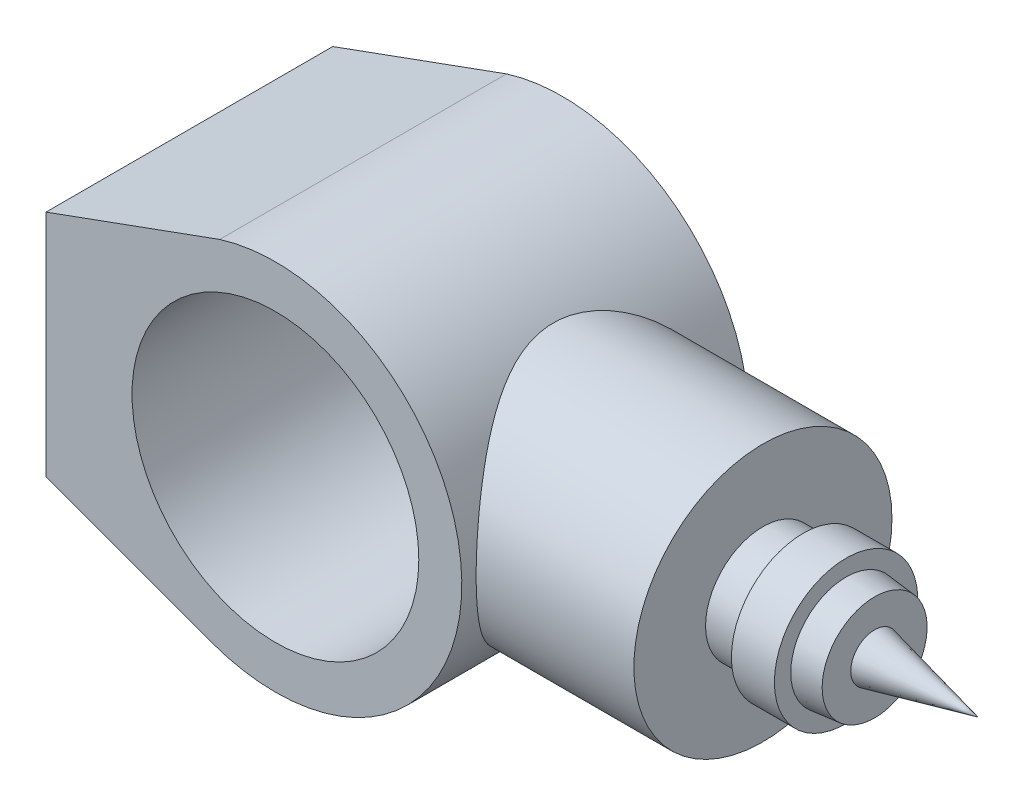
ISO-10303-21;
HEADER;
FILE_DESCRIPTION(('STEP AP214'),'2;1');
FILE_NAME('part.step','',(''),(''),'','','');
FILE_SCHEMA(('AUTOMOTIVE_DESIGN { 1 0 10303 214 1 1 1 1 }'));
ENDSEC;
DATA;
#1=APPLICATION_CONTEXT('core data for automotive mechanical design processes');
#2=APPLICATION_PROTOCOL_DEFINITION('international standard','automotive_design',2000,#1);
#3=PRODUCT_CONTEXT('',#1,'mechanical');
#4=PRODUCT('Part','Part','',(#3));
#5=PRODUCT_RELATED_PRODUCT_CATEGORY('part','',(#4));
#6=PRODUCT_DEFINITION_FORMATION('','',#4);
#7=PRODUCT_DEFINITION_CONTEXT('part definition',#1,'design');
#8=PRODUCT_DEFINITION('design','',#6,#7);
#9=PRODUCT_DEFINITION_SHAPE('','',#8);
#10=(LENGTH_UNIT() NAMED_UNIT(*) SI_UNIT(.MILLI.,.METRE.));
#11=(NAMED_UNIT(*) PLANE_ANGLE_UNIT() SI_UNIT($,.RADIAN.));
#12=(NAMED_UNIT(*) SI_UNIT($,.STERADIAN.) SOLID_ANGLE_UNIT());
#13=UNCERTAINTY_MEASURE_WITH_UNIT(LENGTH_MEASURE(1.E-05),#10,'distance_accuracy_value','');
#14=(GEOMETRIC_REPRESENTATION_CONTEXT(3) GLOBAL_UNCERTAINTY_ASSIGNED_CONTEXT((#13)) GLOBAL_UNIT_ASSIGNED_CONTEXT((#10,
#11,#12)) REPRESENTATION_CONTEXT('',''));
#15=CARTESIAN_POINT('',(0.,0.,0.));
#16=DIRECTION('',(0.,0.,1.));
#17=DIRECTION('',(1.,0.,0.));
#18=AXIS2_PLACEMENT_3D('',#15,#16,#17);
#19=CARTESIAN_POINT('',(0.,0.,50.));
#20=DIRECTION('',(0.,0.,1.));
#21=DIRECTION('',(1.,0.,0.));
#22=AXIS2_PLACEMENT_3D('',#19,#20,#21);
#23=PLANE('',#22);
#24=CARTESIAN_POINT('',(0.,0.,50.));
#25=DIRECTION('',(0.,0.,1.));
#26=DIRECTION('',(1.,0.,0.));
#27=AXIS2_PLACEMENT_3D('',#24,#25,#26);
#28=CIRCLE('',#27,65.);
#29=CARTESIAN_POINT('',(-22.2816656929027,-61.0616686141947,50.));
#30=VERTEX_POINT('',#29);
#31=CARTESIAN_POINT('',(-19.4212773324863,62.0307503321913,50.));
#32=VERTEX_POINT('',#31);
#33=EDGE_CURVE('E205',#30,#32,#28,.T.);
#34=ORIENTED_EDGE('',*,*,#33,.T.);
#35=DIRECTION('',(-0.939782840858083,-0.341772163917296,0.));
#36=VECTOR('',#35,1.);
#37=CARTESIAN_POINT('',(-80.,40.,50.));
#38=LINE('',#37,#36);
#39=CARTESIAN_POINT('',(-80.,40.,50.));
#40=VERTEX_POINT('',#39);
#41=EDGE_CURVE('E92',#32,#40,#38,.T.);
#42=ORIENTED_EDGE('',*,*,#41,.T.);
#43=DIRECTION('',(0.,-1.,0.));
#44=VECTOR('',#43,1.);
#45=CARTESIAN_POINT('',(-80.,-40.,50.));
#46=LINE('',#45,#44);
#47=CARTESIAN_POINT('',(-80.,-40.,50.));
#48=VERTEX_POINT('',#47);
#49=EDGE_CURVE('E201',#40,#48,#46,.T.);
#50=ORIENTED_EDGE('',*,*,#49,.T.);
#51=DIRECTION('',(0.939410286372225,-0.342794856813887,0.));
#52=VECTOR('',#51,1.);
#53=CARTESIAN_POINT('',(-80.,-40.,50.));
#54=LINE('',#53,#52);
#55=EDGE_CURVE('E61',#48,#30,#54,.T.);
#56=ORIENTED_EDGE('',*,*,#55,.T.);
#57=EDGE_LOOP('',(#34,#42,#50,#56));
#58=FACE_BOUND('',#57,.T.);
#59=CARTESIAN_POINT('',(0.,0.,50.));
#60=DIRECTION('',(0.,0.,1.));
#61=DIRECTION('',(1.,0.,0.));
#62=AXIS2_PLACEMENT_3D('',#59,#60,#61);
#63=CIRCLE('',#62,50.);
#64=CARTESIAN_POINT('',(50.,0.,50.));
#65=VERTEX_POINT('',#64);
#66=EDGE_CURVE('E137',#65,#65,#63,.T.);
#67=ORIENTED_EDGE('',*,*,#66,.F.);
#68=EDGE_LOOP('',(#67));
#69=FACE_BOUND('',#68,.T.);
#70=ADVANCED_FACE('F44',(#58,#69),#23,.T.);
#71=CARTESIAN_POINT('',(0.,0.,-50.));
#72=DIRECTION('',(0.,0.,1.));
#73=DIRECTION('',(1.,0.,0.));
#74=AXIS2_PLACEMENT_3D('',#71,#72,#73);
#75=PLANE('',#74);
#76=CARTESIAN_POINT('',(0.,0.,-50.));
#77=DIRECTION('',(0.,0.,1.));
#78=DIRECTION('',(1.,0.,0.));
#79=AXIS2_PLACEMENT_3D('',#76,#77,#78);
#80=CIRCLE('',#79,65.);
#81=CARTESIAN_POINT('',(-22.2816656929027,-61.0616686141947,-50.));
#82=VERTEX_POINT('',#81);
#83=CARTESIAN_POINT('',(-19.4212773324863,62.0307503321913,-50.));
#84=VERTEX_POINT('',#83);
#85=EDGE_CURVE('E199',#82,#84,#80,.T.);
#86=ORIENTED_EDGE('',*,*,#85,.F.);
#87=DIRECTION('',(0.939410286372225,-0.342794856813887,0.));
#88=VECTOR('',#87,1.);
#89=CARTESIAN_POINT('',(-80.,-40.,-50.));
#90=LINE('',#89,#88);
#91=CARTESIAN_POINT('',(-80.,-40.,-50.));
#92=VERTEX_POINT('',#91);
#93=EDGE_CURVE('E85',#92,#82,#90,.T.);
#94=ORIENTED_EDGE('',*,*,#93,.F.);
#95=DIRECTION('',(0.,-1.,0.));
#96=VECTOR('',#95,1.);
#97=CARTESIAN_POINT('',(-80.,-40.,-50.));
#98=LINE('',#97,#96);
#99=CARTESIAN_POINT('',(-80.,40.,-50.));
#100=VERTEX_POINT('',#99);
#101=EDGE_CURVE('E79',#100,#92,#98,.T.);
#102=ORIENTED_EDGE('',*,*,#101,.F.);
#103=DIRECTION('',(-0.939782840858083,-0.341772163917296,0.));
#104=VECTOR('',#103,1.);
#105=CARTESIAN_POINT('',(-80.,40.,-50.));
#106=LINE('',#105,#104);
#107=EDGE_CURVE('E194',#84,#100,#106,.T.);
#108=ORIENTED_EDGE('',*,*,#107,.F.);
#109=EDGE_LOOP('',(#86,#94,#102,#108));
#110=FACE_BOUND('',#109,.T.);
#111=CARTESIAN_POINT('',(0.,0.,-50.));
#112=DIRECTION('',(0.,0.,1.));
#113=DIRECTION('',(1.,0.,0.));
#114=AXIS2_PLACEMENT_3D('',#111,#112,#113);
#115=CIRCLE('',#114,50.);
#116=CARTESIAN_POINT('',(50.,0.,-50.));
#117=VERTEX_POINT('',#116);
#118=EDGE_CURVE('E129',#117,#117,#115,.T.);
#119=ORIENTED_EDGE('',*,*,#118,.T.);
#120=EDGE_LOOP('',(#119));
#121=FACE_BOUND('',#120,.T.);
#122=ADVANCED_FACE('F174',(#110,#121),#75,.F.);
#123=CARTESIAN_POINT('',(0.,0.,50.));
#124=DIRECTION('',(0.,0.,-1.));
#125=DIRECTION('',(-1.,0.,0.));
#126=AXIS2_PLACEMENT_3D('',#123,#124,#125);
#127=CYLINDRICAL_SURFACE('',#126,65.);
#128=CARTESIAN_POINT('',(65.,0.,-45.));
#129=CARTESIAN_POINT('',(65.0000011696057,1.12147330120565,-45.0000012025283));
#130=CARTESIAN_POINT('',(64.9709159765212,2.24292945230778,-44.9580201602482));
#131=CARTESIAN_POINT('',(64.8553068641383,4.47658414079082,-44.790785609369));
#132=CARTESIAN_POINT('',(64.7687842573088,5.58878288911931,-44.6655340035371));
#133=CARTESIAN_POINT('',(64.5403785763001,7.79555151848628,-44.3336771879691));
#134=CARTESIAN_POINT('',(64.3984760503456,8.89011506447751,-44.1270433931238));
#135=CARTESIAN_POINT('',(64.0626457436966,11.0533096019768,-43.6354760134034));
#136=CARTESIAN_POINT('',(63.8687169569864,12.1219400915896,-43.3505409144375));
#137=CARTESIAN_POINT('',(63.4342222744662,14.2212125160505,-42.7078017297046));
#138=CARTESIAN_POINT('',(63.1938918545645,15.2520162370063,-42.3503651251477));
#139=CARTESIAN_POINT('',(62.6709259446924,17.2756280115286,-41.5659763086892));
#140=CARTESIAN_POINT('',(62.3882907364915,18.268436318107,-41.1390245597888));
#141=CARTESIAN_POINT('',(61.786108553932,20.2116697228795,-40.2199419970838));
#142=CARTESIAN_POINT('',(61.4665619062631,21.1620951960855,-39.7278117601444));
#143=CARTESIAN_POINT('',(60.7962171584065,23.0172309124314,-38.6825647509799));
#144=CARTESIAN_POINT('',(60.4454175300334,23.9219389167185,-38.1294449962195));
#145=CARTESIAN_POINT('',(59.6865648974474,25.7601880140228,-36.9151737617935));
#146=CARTESIAN_POINT('',(59.27618815402,26.6893215363404,-36.2488040005491));
#147=CARTESIAN_POINT('',(58.4330275057249,28.4880338622967,-34.8529502059224));
#148=CARTESIAN_POINT('',(58.0002425478181,29.3576098626539,-34.1234632053608));
#149=CARTESIAN_POINT('',(57.1195111836477,31.0364486388513,-32.6040251352403));
#150=CARTESIAN_POINT('',(56.6715447181891,31.8456267033451,-31.8139921794123));
#151=CARTESIAN_POINT('',(55.7691986061138,33.4006700551814,-30.1773036556993));
#152=CARTESIAN_POINT('',(55.3148185876119,34.1465316534289,-29.3306447936721));
#153=CARTESIAN_POINT('',(54.3303114345595,35.6959084068904,-27.4326466159468));
#154=CARTESIAN_POINT('',(53.8005937511269,36.4872853280241,-26.3711450656527));
#155=CARTESIAN_POINT('',(52.7593327891933,37.9773509509911,-24.17604025639));
#156=CARTESIAN_POINT('',(52.2477941160227,38.6760162868262,-23.0424189272517));
#157=CARTESIAN_POINT('',(51.2608149265043,39.9749077721744,-20.7072341856928));
#158=CARTESIAN_POINT('',(50.7853275075273,40.5752630453964,-19.5057627267967));
#159=CARTESIAN_POINT('',(49.8892399163793,41.6721166930025,-17.036931864064));
#160=CARTESIAN_POINT('',(49.4686114171658,42.1686687478853,-15.7696069409943));
#161=CARTESIAN_POINT('',(48.8208029416879,42.9149535309565,-13.5723996352816));
#162=CARTESIAN_POINT('',(48.5738420263557,43.1936925213245,-12.6581208440976));
#163=CARTESIAN_POINT('',(48.1238801744123,43.6944569649788,-10.8035389223551));
#164=CARTESIAN_POINT('',(47.9208721021929,43.9164916250901,-9.86324004407419));
#165=CARTESIAN_POINT('',(47.5660754926548,44.3005296261305,-7.96250438663409));
#166=CARTESIAN_POINT('',(47.4142038087044,44.4626304606427,-7.00210302149487));
#167=CARTESIAN_POINT('',(47.1671263845177,44.7246555122386,-5.06554052628518));
#168=CARTESIAN_POINT('',(47.0719206259529,44.824579749433,-4.08937940131224));
#169=CARTESIAN_POINT('',(46.9418899090943,44.9607388198673,-2.1232364847967));
#170=CARTESIAN_POINT('',(46.9073939345417,44.9966266570423,-1.13320851844658));
#171=CARTESIAN_POINT('',(46.9013571135476,45.0029190462422,0.847248377093852));
#172=CARTESIAN_POINT('',(46.9298161498631,44.9733237202183,1.837677305534));
#173=CARTESIAN_POINT('',(47.0484302849821,44.8492190899201,3.81128752429081));
#174=CARTESIAN_POINT('',(47.13862305521,44.7546701492421,4.79446401850661));
#175=CARTESIAN_POINT('',(47.3768313176079,44.5024241630868,6.74551496467455));
#176=CARTESIAN_POINT('',(47.5248480621437,44.3447257499009,7.71338908473168));
#177=CARTESIAN_POINT('',(47.8621764271841,43.9803320764262,9.56919366964684));
#178=CARTESIAN_POINT('',(48.0484149088864,43.7772163066585,10.4583970625519));
#179=CARTESIAN_POINT('',(48.4609441046406,43.32010640119,12.2144143492181));
#180=CARTESIAN_POINT('',(48.6872496045115,43.0660934784815,13.0812198417583));
#181=CARTESIAN_POINT('',(49.1738509640383,42.5096331932465,14.7898225666927));
#182=CARTESIAN_POINT('',(49.4341648638834,42.2071601049958,15.6316062329481));
#183=CARTESIAN_POINT('',(49.9825182796335,41.5563350032134,17.2876417419013));
#184=CARTESIAN_POINT('',(50.2705534011697,41.2079902580444,18.1018979206949));
#185=CARTESIAN_POINT('',(51.0225431471345,40.2767822129268,20.1137766396802));
#186=CARTESIAN_POINT('',(51.5007434523328,39.6654891440572,21.2930273345177));
#187=CARTESIAN_POINT('',(52.4891158781477,38.348029920852,23.5833678403921));
#188=CARTESIAN_POINT('',(52.9993005340589,37.6418264436726,24.6944305853524));
#189=CARTESIAN_POINT('',(54.0361557973494,36.1376496350166,26.8476775780095));
#190=CARTESIAN_POINT('',(54.5628535785461,35.3395185623559,27.8897384505711));
#191=CARTESIAN_POINT('',(55.6171804467178,33.6558443419671,29.8998791095632));
#192=CARTESIAN_POINT('',(56.1448094104418,32.7703120184234,30.8679680307498));
#193=CARTESIAN_POINT('',(57.1932449701135,30.9045304086319,32.7363921475659));
#194=CARTESIAN_POINT('',(57.7139191350983,29.9233731295192,33.6358963165067));
#195=CARTESIAN_POINT('',(58.7296419536465,27.8771206485979,35.350355349792));
#196=CARTESIAN_POINT('',(59.2246882700661,26.8120178135979,36.1653025097018));
#197=CARTESIAN_POINT('',(60.1756566955639,24.6035209522421,37.7024332048813));
#198=CARTESIAN_POINT('',(60.6316475651595,23.4602711709794,38.4247809320632));
#199=CARTESIAN_POINT('',(61.4931891608211,21.0989507187335,39.7703323765769));
#200=CARTESIAN_POINT('',(61.898755017873,19.8809026570889,40.3935658507715));
#201=CARTESIAN_POINT('',(62.5646802947783,17.6549035875762,41.4059204565395));
#202=CARTESIAN_POINT('',(62.8372982548467,16.6602403417733,41.8163120535009));
#203=CARTESIAN_POINT('',(63.3397164077328,14.6345031625144,42.5675669112335));
#204=CARTESIAN_POINT('',(63.569522535998,13.603434299959,42.9084398107234));
#205=CARTESIAN_POINT('',(63.9815049902596,11.5110112910016,43.5164676119118));
#206=CARTESIAN_POINT('',(64.1637052650743,10.4496726714621,43.7836595836378));
#207=CARTESIAN_POINT('',(64.476639865795,8.30296993183371,44.2409869387356));
#208=CARTESIAN_POINT('',(64.6073730982257,7.21760530180254,44.431120684921));
#209=CARTESIAN_POINT('',(64.8147345736682,5.02649787175023,44.7321113931983));
#210=CARTESIAN_POINT('',(64.8911534961694,3.92069290489763,44.8426616714377));
#211=CARTESIAN_POINT('',(64.9872183357685,1.70145350776208,44.981563734156));
#212=CARTESIAN_POINT('',(65.0068642771874,0.588019080747696,45.0099155538474));
#213=CARTESIAN_POINT('',(64.9889001241945,-1.63741781931566,44.9839662509349));
#214=CARTESIAN_POINT('',(64.9512898349751,-2.74942028747967,44.929664847113));
#215=CARTESIAN_POINT('',(64.819734418053,-4.96298947367603,44.7392747901952));
#216=CARTESIAN_POINT('',(64.7257910494465,-6.06455651648127,44.6031886909653));
#217=CARTESIAN_POINT('',(64.491175703309,-8.18254449212149,44.2620157992034));
#218=CARTESIAN_POINT('',(64.3536808680178,-9.20007959997774,44.0616107864454));
#219=CARTESIAN_POINT('',(64.0337856060908,-11.2121337136589,43.5930613516679));
#220=CARTESIAN_POINT('',(63.8513873855499,-12.2066538475799,43.3249202574929));
#221=CARTESIAN_POINT('',(63.4451725249075,-14.1673074608523,42.7239854011605));
#222=CARTESIAN_POINT('',(63.2213525684632,-15.1334386601223,42.3911864622047));
#223=CARTESIAN_POINT('',(62.736336352677,-17.0327019487273,41.6643868113868));
#224=CARTESIAN_POINT('',(62.4751380044848,-17.965832190203,41.2703826790343));
#225=CARTESIAN_POINT('',(61.8990085085122,-19.8637431772395,40.3931275129008));
#226=CARTESIAN_POINT('',(61.5815209528501,-20.8256806929253,39.9054081529014));
#227=CARTESIAN_POINT('',(60.9142086391395,-22.7035764997345,38.8677076181211));
#228=CARTESIAN_POINT('',(60.5643826081083,-23.6195329786528,38.3177239921568));
#229=CARTESIAN_POINT('',(59.8381347129401,-25.4032558353403,37.1592008079418));
#230=CARTESIAN_POINT('',(59.4616987975441,-26.270996314329,36.5506302507532));
#231=CARTESIAN_POINT('',(58.6884577670336,-27.9557544991496,35.2787474176625));
#232=CARTESIAN_POINT('',(58.2916515549571,-28.7727694681138,34.6154321925309));
#233=CARTESIAN_POINT('',(57.4151711853793,-30.4889708749912,33.1199200847161));
#234=CARTESIAN_POINT('',(56.9328754552547,-31.3785212006928,32.2781812569548));
#235=CARTESIAN_POINT('',(55.9590893109094,-33.0839042215169,30.5278352445589));
#236=CARTESIAN_POINT('',(55.4675975421249,-33.8997259516808,29.6192181500899));
#237=CARTESIAN_POINT('',(54.4860350387397,-35.45586994741,27.7375714933993));
#238=CARTESIAN_POINT('',(53.9959654596117,-36.1961418986443,26.7644997080007));
#239=CARTESIAN_POINT('',(53.0294834997435,-37.5978502361011,24.7568233036382));
#240=CARTESIAN_POINT('',(52.553069328415,-38.2592969946585,23.7222268074148));
#241=CARTESIAN_POINT('',(51.679941347726,-39.4291013564639,21.7149007388747));
#242=CARTESIAN_POINT('',(51.2803372484816,-39.9463152685162,20.7485884228094));
#243=CARTESIAN_POINT('',(50.5123974548912,-40.9130636661729,18.7705314851885));
#244=CARTESIAN_POINT('',(50.1440619804653,-41.3625976757848,17.7587865441704));
#245=CARTESIAN_POINT('',(49.4504928922364,-42.1893301292689,15.693797265063));
#246=CARTESIAN_POINT('',(49.1251906412473,-42.566644202947,14.6406225749502));
#247=CARTESIAN_POINT('',(48.5290098021012,-43.2451098617227,12.4950157035289));
#248=CARTESIAN_POINT('',(48.2581179989952,-43.5462799449171,11.4025931307277));
#249=CARTESIAN_POINT('',(47.8271610412375,-44.0186874861181,9.3921629994351));
#250=CARTESIAN_POINT('',(47.6558419905218,-44.2036946073207,8.47979353570419));
#251=CARTESIAN_POINT('',(47.3627606953031,-44.517583244497,6.63757582668245));
#252=CARTESIAN_POINT('',(47.2409923142224,-44.6464717105955,5.70772976070373));
#253=CARTESIAN_POINT('',(47.05166615705,-44.8459556683364,3.83718735816971));
#254=CARTESIAN_POINT('',(46.9840561376509,-44.9166073394187,2.89650236820514));
#255=CARTESIAN_POINT('',(46.9055698265682,-44.9985645522097,1.01014116515035));
#256=CARTESIAN_POINT('',(46.894694331428,-45.0098692606967,0.0644648821697862));
#257=CARTESIAN_POINT('',(46.9301408777119,-44.972908524549,-1.82506201386804));
#258=CARTESIAN_POINT('',(46.9764888551696,-44.9246160680299,-2.76891160474201));
#259=CARTESIAN_POINT('',(47.1245232303033,-44.7693052695385,-4.64731891289862));
#260=CARTESIAN_POINT('',(47.226209296244,-44.6622872796082,-5.58187668584874));
#261=CARTESIAN_POINT('',(47.4811423262629,-44.3911660407895,-7.43666598606561));
#262=CARTESIAN_POINT('',(47.634452919394,-44.2269923369625,-8.35687836049678));
#263=CARTESIAN_POINT('',(47.9871889035597,-43.8440109221367,-10.1768310643423));
#264=CARTESIAN_POINT('',(48.1866204648689,-43.6251959006593,-11.0765686368372));
#265=CARTESIAN_POINT('',(48.6908782922366,-43.0625185245671,-13.116726178063));
#266=CARTESIAN_POINT('',(49.0093972350599,-42.7008255731353,-14.2488681052183));
#267=CARTESIAN_POINT('',(49.699554494161,-41.8955268796886,-16.4668795226373));
#268=CARTESIAN_POINT('',(50.0712093704162,-41.4518955887103,-17.5527344499461));
#269=CARTESIAN_POINT('',(50.8544123719762,-40.4872212981013,-19.6760329984318));
#270=CARTESIAN_POINT('',(51.2660067549033,-39.9660881554129,-20.7134183727638));
#271=CARTESIAN_POINT('',(52.116211879306,-38.8508952329155,-22.7363587217865));
#272=CARTESIAN_POINT('',(52.5548209260535,-38.2568400254561,-23.7219169406072));
#273=CARTESIAN_POINT('',(53.4579357785502,-36.9847423381263,-25.6613286822633));
#274=CARTESIAN_POINT('',(53.9228021101371,-36.3051118639051,-26.6139712103077));
#275=CARTESIAN_POINT('',(54.8583333343946,-34.8753950985048,-28.4617532840731));
#276=CARTESIAN_POINT('',(55.3289982185488,-34.1253089107936,-29.3568929142368));
#277=CARTESIAN_POINT('',(56.2664339133503,-32.5564691651912,-31.0876310121466));
#278=CARTESIAN_POINT('',(56.7332035093429,-31.7376950080829,-31.923211478402));
#279=CARTESIAN_POINT('',(57.6535165855435,-30.033481652025,-33.5315189390535));
#280=CARTESIAN_POINT('',(58.1070588196762,-29.1480362003111,-34.3042400240121));
#281=CARTESIAN_POINT('',(59.0635284336244,-27.1643113596245,-35.9022819462667));
#282=CARTESIAN_POINT('',(59.5626106290919,-26.0547472869609,-36.7159606163356));
#283=CARTESIAN_POINT('',(60.5176757229357,-23.7521280348398,-38.2458641369291));
#284=CARTESIAN_POINT('',(60.9736519283074,-22.5590599397198,-38.962073861155));
#285=CARTESIAN_POINT('',(61.6149926579414,-20.7127348127311,-39.9558623322098));
#286=CARTESIAN_POINT('',(61.8215919655179,-20.088110583999,-40.2735888165198));
#287=CARTESIAN_POINT('',(62.2191547005856,-18.8206694867556,-40.8812436548858));
#288=CARTESIAN_POINT('',(62.4101203779565,-18.1778552539997,-41.1711760099034));
#289=CARTESIAN_POINT('',(62.7748527233683,-16.875283117665,-41.7219931318356));
#290=CARTESIAN_POINT('',(62.9486230408552,-16.2155288469421,-41.9828840638124));
#291=CARTESIAN_POINT('',(63.2775356475737,-14.8804011558233,-42.4744610119283));
#292=CARTESIAN_POINT('',(63.432679284421,-14.2050288695917,-42.7051492133046));
#293=CARTESIAN_POINT('',(63.8070721968101,-12.4447010544915,-43.25974494481));
#294=CARTESIAN_POINT('',(64.0114184468014,-11.3490405228654,-43.5602757498286));
#295=CARTESIAN_POINT('',(64.3654191982087,-9.12991345978806,-44.078827644396));
#296=CARTESIAN_POINT('',(64.5150820049425,-8.00645117856259,-44.2968612637911));
#297=CARTESIAN_POINT('',(64.7559993187061,-5.74082253729113,-44.6470112993716));
#298=CARTESIAN_POINT('',(64.847297757104,-4.59867091062173,-44.7791923387443));
#299=CARTESIAN_POINT('',(64.9692976296881,-2.30434018473195,-44.9556862638234));
#300=CARTESIAN_POINT('',(64.9999987983895,-1.15216104160189,-44.999998764566));
#301=CARTESIAN_POINT('',(65.,0.,-45.));
#302=B_SPLINE_CURVE_WITH_KNOTS('',3,(#128,#129,#130,#131,#132,#133,#134,#135,#136,#137,#138,
#139,#140,#141,#142,#143,#144,#145,#146,#147,#148,#149,#150,#151,#152,#153,#154,#155,#156,#157,
#158,#159,#160,#161,#162,#163,#164,#165,#166,#167,#168,#169,#170,#171,#172,#173,#174,#175,#176,
#177,#178,#179,#180,#181,#182,#183,#184,#185,#186,#187,#188,#189,#190,#191,#192,#193,#194,#195,
#196,#197,#198,#199,#200,#201,#202,#203,#204,#205,#206,#207,#208,#209,#210,#211,#212,#213,#214,
#215,#216,#217,#218,#219,#220,#221,#222,#223,#224,#225,#226,#227,#228,#229,#230,#231,#232,#233,
#234,#235,#236,#237,#238,#239,#240,#241,#242,#243,#244,#245,#246,#247,#248,#249,#250,#251,#252,
#253,#254,#255,#256,#257,#258,#259,#260,#261,#262,#263,#264,#265,#266,#267,#268,#269,#270,#271,
#272,#273,#274,#275,#276,#277,#278,#279,#280,#281,#282,#283,#284,#285,#286,#287,#288,#289,#290,
#291,#292,#293,#294,#295,#296,#297,#298,#299,#300,#301),.UNSPECIFIED.,.T.,.F.,(4,2,2,2,2,2,2,2,
2,2,2,2,2,2,2,2,2,2,2,2,2,2,2,2,2,2,2,2,2,2,2,2,2,2,2,2,2,2,2,2,2,2,2,2,2,2,2,2,2,2,2,2,2,2,2,2,
2,2,2,2,2,2,2,2,2,2,2,2,2,2,2,2,2,2,2,2,2,2,2,2,2,2,2,2,2,2,4),(0.,3.36323892794144,
6.72640100710137,10.0907454360665,13.4551549250109,16.8029195613731,20.1506619010729,
23.4983746134034,26.8462511096753,30.4871649037346,34.1282499524345,37.7743494260164,
41.4206611917409,45.6939383064405,49.9682903731881,54.2369825353392,58.5034617073671,
61.4625138492405,64.4210852373372,67.3748225577202,70.3285589227263,73.2982527376573,
76.2679410220407,79.2394430998938,82.2110095388412,85.0011411726389,87.7923045951578,
90.584954683776,93.3771628083065,97.6064034875675,101.837312178738,106.075592113262,
110.313347816192,114.596218662803,118.879479402292,123.155037051935,127.429308626693,
130.755998382163,134.082226580387,137.406778235214,140.731400520075,144.068767009318,
147.406132068879,150.743508483461,154.080780688207,157.215791533369,160.350648386749,
163.485756334407,166.621039552604,169.990545063149,173.360183268584,176.73161428665,
180.103227050672,184.047902440152,187.993163521895,191.94103513809,195.888386692538,
199.385185586645,202.88200907258,206.373186157811,209.863514294626,212.700365177753,
215.536864625513,218.370624567028,221.204424293963,224.039508887241,226.874576485218,
229.713151272815,232.55210603787,236.23803941247,239.925124033801,243.616531168718,
247.307706963636,251.081871120678,254.856029735252,258.631324277359,262.406973327354,
266.792058434818,271.177823293658,273.368885604935,275.55963203795,277.749912517597,
279.940034437727,283.398420446896,286.856280978073,290.31153567335,293.766805506531),.UNSPECIFIED.);
#303=CARTESIAN_POINT('',(65.,0.,-45.));
#304=VERTEX_POINT('',#303);
#305=EDGE_CURVE('E125',#304,#304,#302,.T.);
#306=ORIENTED_EDGE('',*,*,#305,.F.);
#307=EDGE_LOOP('',(#306));
#308=FACE_BOUND('',#307,.T.);
#309=ORIENTED_EDGE('',*,*,#85,.T.);
#310=DIRECTION('',(0.,0.,-1.));
#311=VECTOR('',#310,1.);
#312=CARTESIAN_POINT('',(-19.4212773324863,62.0307503321913,50.));
#313=LINE('',#312,#311);
#314=EDGE_CURVE('E11',#32,#84,#313,.T.);
#315=ORIENTED_EDGE('',*,*,#314,.F.);
#316=ORIENTED_EDGE('',*,*,#33,.F.);
#317=DIRECTION('',(0.,0.,-1.));
#318=VECTOR('',#317,1.);
#319=CARTESIAN_POINT('',(-22.2816656929027,-61.0616686141947,50.));
#320=LINE('',#319,#318);
#321=EDGE_CURVE('E209',#30,#82,#320,.T.);
#322=ORIENTED_EDGE('',*,*,#321,.T.);
#323=EDGE_LOOP('',(#309,#315,#316,#322));
#324=FACE_BOUND('',#323,.T.);
#325=ADVANCED_FACE('F46',(#308,#324),#127,.T.);
#326=CARTESIAN_POINT('',(-80.,40.,50.));
#327=DIRECTION('',(0.341772163917296,-0.939782840858083,0.));
#328=DIRECTION('',(0.939782840858083,0.341772163917296,0.));
#329=AXIS2_PLACEMENT_3D('',#326,#327,#328);
#330=PLANE('',#329);
#331=ORIENTED_EDGE('',*,*,#107,.T.);
#332=DIRECTION('',(0.,0.,-1.));
#333=VECTOR('',#332,1.);
#334=CARTESIAN_POINT('',(-80.,40.,50.));
#335=LINE('',#334,#333);
#336=EDGE_CURVE('E53',#40,#100,#335,.T.);
#337=ORIENTED_EDGE('',*,*,#336,.F.);
#338=ORIENTED_EDGE('',*,*,#41,.F.);
#339=ORIENTED_EDGE('',*,*,#314,.T.);
#340=EDGE_LOOP('',(#331,#337,#338,#339));
#341=FACE_BOUND('',#340,.T.);
#342=ADVANCED_FACE('F188',(#341),#330,.F.);
#343=CARTESIAN_POINT('',(-80.,-40.,50.));
#344=DIRECTION('',(1.,0.,0.));
#345=DIRECTION('',(0.,1.,0.));
#346=AXIS2_PLACEMENT_3D('',#343,#344,#345);
#347=PLANE('',#346);
#348=ORIENTED_EDGE('',*,*,#101,.T.);
#349=DIRECTION('',(0.,0.,-1.));
#350=VECTOR('',#349,1.);
#351=CARTESIAN_POINT('',(-80.,-40.,50.));
#352=LINE('',#351,#350);
#353=EDGE_CURVE('E202',#48,#92,#352,.T.);
#354=ORIENTED_EDGE('',*,*,#353,.F.);
#355=ORIENTED_EDGE('',*,*,#49,.F.);
#356=ORIENTED_EDGE('',*,*,#336,.T.);
#357=EDGE_LOOP('',(#348,#354,#355,#356));
#358=FACE_BOUND('',#357,.T.);
#359=ADVANCED_FACE('F186',(#358),#347,.F.);
#360=CARTESIAN_POINT('',(-80.,-40.,50.));
#361=DIRECTION('',(0.342794856813887,0.939410286372225,0.));
#362=DIRECTION('',(-0.939410286372225,0.342794856813887,0.));
#363=AXIS2_PLACEMENT_3D('',#360,#361,#362);
#364=PLANE('',#363);
#365=ORIENTED_EDGE('',*,*,#93,.T.);
#366=ORIENTED_EDGE('',*,*,#321,.F.);
#367=ORIENTED_EDGE('',*,*,#55,.F.);
#368=ORIENTED_EDGE('',*,*,#353,.T.);
#369=EDGE_LOOP('',(#365,#366,#367,#368));
#370=FACE_BOUND('',#369,.T.);
#371=ADVANCED_FACE('F183',(#370),#364,.F.);
#372=CARTESIAN_POINT('',(0.,0.,50.));
#373=DIRECTION('',(0.,0.,-1.));
#374=DIRECTION('',(-1.,0.,0.));
#375=AXIS2_PLACEMENT_3D('',#372,#373,#374);
#376=CYLINDRICAL_SURFACE('',#375,50.);
#377=ORIENTED_EDGE('',*,*,#66,.T.);
#378=EDGE_LOOP('',(#377));
#379=FACE_BOUND('',#378,.T.);
#380=ORIENTED_EDGE('',*,*,#118,.F.);
#381=EDGE_LOOP('',(#380));
#382=FACE_BOUND('',#381,.T.);
#383=ADVANCED_FACE('F147',(#379,#382),#376,.F.);
#384=CARTESIAN_POINT('',(120.,0.,0.));
#385=DIRECTION('',(1.,0.,0.));
#386=DIRECTION('',(0.,0.,-1.));
#387=AXIS2_PLACEMENT_3D('',#384,#385,#386);
#388=PLANE('',#387);
#389=CARTESIAN_POINT('',(120.,0.,0.));
#390=DIRECTION('',(-1.,0.,0.));
#391=DIRECTION('',(0.,0.,1.));
#392=AXIS2_PLACEMENT_3D('',#389,#390,#391);
#393=CIRCLE('',#392,20.);
#394=CARTESIAN_POINT('',(120.,0.,20.));
#395=VERTEX_POINT('',#394);
#396=EDGE_CURVE('E122',#395,#395,#393,.T.);
#397=ORIENTED_EDGE('',*,*,#396,.T.);
#398=EDGE_LOOP('',(#397));
#399=FACE_BOUND('',#398,.T.);
#400=CARTESIAN_POINT('',(120.,0.,0.));
#401=DIRECTION('',(1.,0.,0.));
#402=DIRECTION('',(0.,0.,-1.));
#403=AXIS2_PLACEMENT_3D('',#400,#401,#402);
#404=CIRCLE('',#403,45.);
#405=CARTESIAN_POINT('',(120.,0.,-45.));
#406=VERTEX_POINT('',#405);
#407=EDGE_CURVE('E126',#406,#406,#404,.T.);
#408=ORIENTED_EDGE('',*,*,#407,.T.);
#409=EDGE_LOOP('',(#408));
#410=FACE_BOUND('',#409,.T.);
#411=ADVANCED_FACE('F144',(#399,#410),#388,.T.);
#412=CARTESIAN_POINT('',(-80.002,0.,0.));
#413=DIRECTION('',(1.,0.,0.));
#414=DIRECTION('',(0.,0.,-1.));
#415=AXIS2_PLACEMENT_3D('',#412,#413,#414);
#416=CYLINDRICAL_SURFACE('',#415,45.);
#417=ORIENTED_EDGE('',*,*,#407,.F.);
#418=EDGE_LOOP('',(#417));
#419=FACE_BOUND('',#418,.T.);
#420=ORIENTED_EDGE('',*,*,#305,.T.);
#421=EDGE_LOOP('',(#420));
#422=FACE_BOUND('',#421,.T.);
#423=ADVANCED_FACE('F139',(#419,#422),#416,.T.);
#424=CARTESIAN_POINT('',(0.,0.,0.));
#425=DIRECTION('',(-1.,0.,0.));
#426=DIRECTION('',(0.,0.,1.));
#427=AXIS2_PLACEMENT_3D('',#424,#425,#426);
#428=CYLINDRICAL_SURFACE('',#427,20.);
#429=CARTESIAN_POINT('',(134.,0.,0.));
#430=DIRECTION('',(-1.,0.,0.));
#431=DIRECTION('',(0.,0.,1.));
#432=AXIS2_PLACEMENT_3D('',#429,#430,#431);
#433=CIRCLE('',#432,20.);
#434=CARTESIAN_POINT('',(134.,0.,20.));
#435=VERTEX_POINT('',#434);
#436=EDGE_CURVE('E119',#435,#435,#433,.T.);
#437=ORIENTED_EDGE('',*,*,#436,.T.);
#438=EDGE_LOOP('',(#437));
#439=FACE_BOUND('',#438,.T.);
#440=ORIENTED_EDGE('',*,*,#396,.F.);
#441=EDGE_LOOP('',(#440));
#442=FACE_BOUND('',#441,.T.);
#443=ADVANCED_FACE('F149',(#439,#442),#428,.T.);
#444=CARTESIAN_POINT('',(134.,-20.,0.));
#445=DIRECTION('',(-1.,0.,0.));
#446=DIRECTION('',(0.,0.,1.));
#447=AXIS2_PLACEMENT_3D('',#444,#445,#446);
#448=PLANE('',#447);
#449=CARTESIAN_POINT('',(134.,0.,0.));
#450=DIRECTION('',(-1.,0.,0.));
#451=DIRECTION('',(0.,0.,1.));
#452=AXIS2_PLACEMENT_3D('',#449,#450,#451);
#453=CIRCLE('',#452,25.);
#454=CARTESIAN_POINT('',(134.,0.,25.));
#455=VERTEX_POINT('',#454);
#456=EDGE_CURVE('E116',#455,#455,#453,.T.);
#457=ORIENTED_EDGE('',*,*,#456,.T.);
#458=EDGE_LOOP('',(#457));
#459=FACE_BOUND('',#458,.T.);
#460=ORIENTED_EDGE('',*,*,#436,.F.);
#461=EDGE_LOOP('',(#460));
#462=FACE_BOUND('',#461,.T.);
#463=ADVANCED_FACE('F152',(#459,#462),#448,.T.);
#464=CARTESIAN_POINT('',(0.,0.,0.));
#465=DIRECTION('',(-1.,0.,0.));
#466=DIRECTION('',(0.,0.,1.));
#467=AXIS2_PLACEMENT_3D('',#464,#465,#466);
#468=CYLINDRICAL_SURFACE('',#467,25.);
#469=CARTESIAN_POINT('',(149.,0.,0.));
#470=DIRECTION('',(-1.,0.,0.));
#471=DIRECTION('',(0.,0.,1.));
#472=AXIS2_PLACEMENT_3D('',#469,#470,#471);
#473=CIRCLE('',#472,25.);
#474=CARTESIAN_POINT('',(149.,0.,25.));
#475=VERTEX_POINT('',#474);
#476=EDGE_CURVE('E113',#475,#475,#473,.T.);
#477=ORIENTED_EDGE('',*,*,#476,.T.);
#478=EDGE_LOOP('',(#477));
#479=FACE_BOUND('',#478,.T.);
#480=ORIENTED_EDGE('',*,*,#456,.F.);
#481=EDGE_LOOP('',(#480));
#482=FACE_BOUND('',#481,.T.);
#483=ADVANCED_FACE('F156',(#479,#482),#468,.T.);
#484=CARTESIAN_POINT('',(149.,-25.,0.));
#485=DIRECTION('',(1.,0.,0.));
#486=DIRECTION('',(0.,0.,-1.));
#487=AXIS2_PLACEMENT_3D('',#484,#485,#486);
#488=PLANE('',#487);
#489=CARTESIAN_POINT('',(149.,0.,0.));
#490=DIRECTION('',(-1.,0.,0.));
#491=DIRECTION('',(0.,0.,1.));
#492=AXIS2_PLACEMENT_3D('',#489,#490,#491);
#493=CIRCLE('',#492,19.2982573113327);
#494=CARTESIAN_POINT('',(149.,0.,19.2982573113327));
#495=VERTEX_POINT('',#494);
#496=EDGE_CURVE('E108',#495,#495,#493,.T.);
#497=ORIENTED_EDGE('',*,*,#496,.T.);
#498=EDGE_LOOP('',(#497));
#499=FACE_BOUND('',#498,.T.);
#500=ORIENTED_EDGE('',*,*,#476,.F.);
#501=EDGE_LOOP('',(#500));
#502=FACE_BOUND('',#501,.T.);
#503=ADVANCED_FACE('F160',(#499,#502),#488,.T.);
#504=CARTESIAN_POINT('',(149.,0.,0.));
#505=DIRECTION('',(-1.,0.,0.));
#506=DIRECTION('',(0.,0.,1.));
#507=AXIS2_PLACEMENT_3D('',#504,#505,#506);
#508=CONICAL_SURFACE('',#507,19.2982573113327,0.0998570933923751);
#509=CARTESIAN_POINT('',(158.950184219727,0.,0.));
#510=DIRECTION('',(-1.,0.,0.));
#511=DIRECTION('',(0.,0.,1.));
#512=AXIS2_PLACEMENT_3D('',#509,#510,#511);
#513=CIRCLE('',#512,18.3013450817521);
#514=CARTESIAN_POINT('',(158.950184219727,0.,18.3013450817521));
#515=VERTEX_POINT('',#514);
#516=EDGE_CURVE('E105',#515,#515,#513,.T.);
#517=ORIENTED_EDGE('',*,*,#516,.T.);
#518=EDGE_LOOP('',(#517));
#519=FACE_BOUND('',#518,.T.);
#520=ORIENTED_EDGE('',*,*,#496,.F.);
#521=EDGE_LOOP('',(#520));
#522=FACE_BOUND('',#521,.T.);
#523=ADVANCED_FACE('F164',(#519,#522),#508,.T.);
#524=CARTESIAN_POINT('',(158.950184219727,-18.3013450817521,0.));
#525=DIRECTION('',(1.,0.,0.));
#526=DIRECTION('',(0.,0.,-1.));
#527=AXIS2_PLACEMENT_3D('',#524,#525,#526);
#528=PLANE('',#527);
#529=CARTESIAN_POINT('',(158.950184219727,0.,0.));
#530=DIRECTION('',(-1.,0.,0.));
#531=DIRECTION('',(0.,0.,1.));
#532=AXIS2_PLACEMENT_3D('',#529,#530,#531);
#533=CIRCLE('',#532,8.33131335435242);
#534=CARTESIAN_POINT('',(158.950184219727,0.,8.33131335435242));
#535=VERTEX_POINT('',#534);
#536=EDGE_CURVE('E103',#535,#535,#533,.T.);
#537=ORIENTED_EDGE('',*,*,#536,.T.);
#538=EDGE_LOOP('',(#537));
#539=FACE_BOUND('',#538,.T.);
#540=ORIENTED_EDGE('',*,*,#516,.F.);
#541=EDGE_LOOP('',(#540));
#542=FACE_BOUND('',#541,.T.);
#543=ADVANCED_FACE('F99',(#539,#542),#528,.T.);
#544=CARTESIAN_POINT('',(158.950184219727,0.,0.));
#545=DIRECTION('',(-1.,0.,0.));
#546=DIRECTION('',(0.,0.,1.));
#547=AXIS2_PLACEMENT_3D('',#544,#545,#546);
#548=CONICAL_SURFACE('',#547,8.33131335435242,0.227118161251766);
#549=CARTESIAN_POINT('',(195.,0.,0.));
#550=VERTEX_POINT('',#549);
#551=VERTEX_LOOP('',#550);
#552=FACE_BOUND('',#551,.T.);
#553=ORIENTED_EDGE('',*,*,#536,.F.);
#554=EDGE_LOOP('',(#553));
#555=FACE_BOUND('',#554,.T.);
#556=ADVANCED_FACE('F96',(#552,#555),#548,.T.);
#557=CLOSED_SHELL('',(#70,#122,#325,#342,#359,#371,#383,#411,#423,#443,#463,#483,#503,#523,#543,#556));
#558=MANIFOLD_SOLID_BREP('B2',#557);
#559=ADVANCED_BREP_SHAPE_REPRESENTATION('',(#18,#558),#14);
#560=SHAPE_DEFINITION_REPRESENTATION(#9,#559);
ENDSEC;
END-ISO-10303-21;
